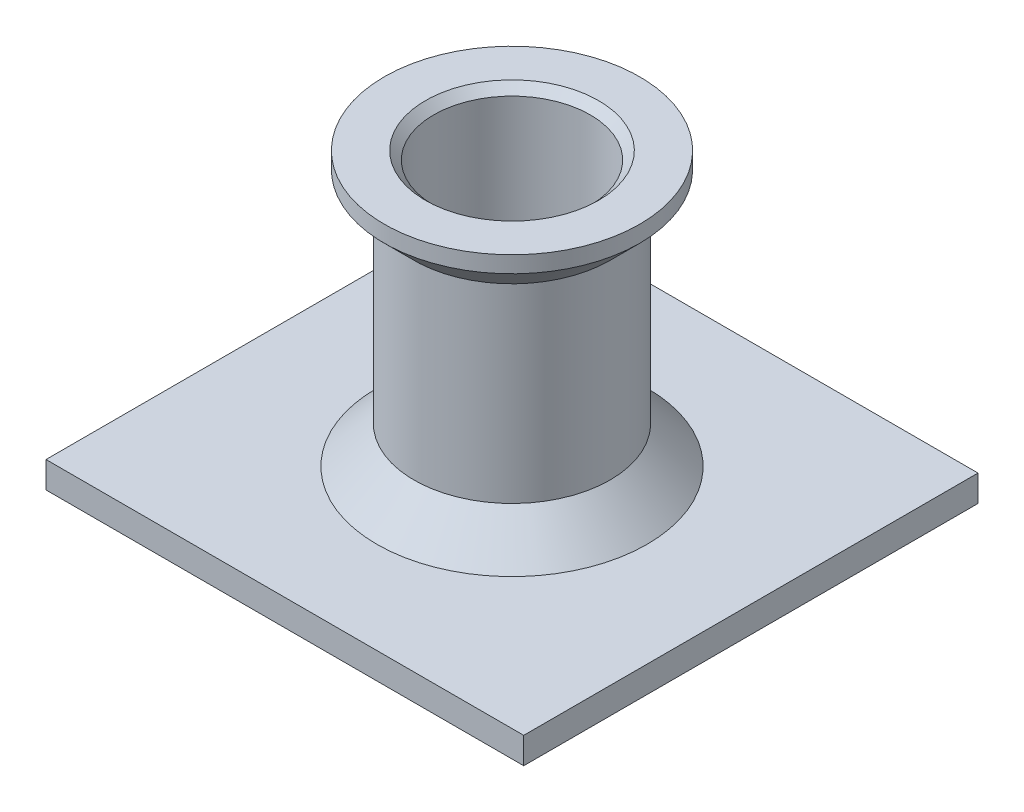
ISO-10303-21;
HEADER;
FILE_DESCRIPTION(('STEP AP214'),'2;1');
FILE_NAME('part.step','',(''),(''),'','','');
FILE_SCHEMA(('AUTOMOTIVE_DESIGN { 1 0 10303 214 1 1 1 1 }'));
ENDSEC;
DATA;
#1=APPLICATION_CONTEXT('core data for automotive mechanical design processes');
#2=APPLICATION_PROTOCOL_DEFINITION('international standard','automotive_design',2000,#1);
#3=PRODUCT_CONTEXT('',#1,'mechanical');
#4=PRODUCT('Part','Part','',(#3));
#5=PRODUCT_RELATED_PRODUCT_CATEGORY('part','',(#4));
#6=PRODUCT_DEFINITION_FORMATION('','',#4);
#7=PRODUCT_DEFINITION_CONTEXT('part definition',#1,'design');
#8=PRODUCT_DEFINITION('design','',#6,#7);
#9=PRODUCT_DEFINITION_SHAPE('','',#8);
#10=(LENGTH_UNIT() NAMED_UNIT(*) SI_UNIT(.MILLI.,.METRE.));
#11=(NAMED_UNIT(*) PLANE_ANGLE_UNIT() SI_UNIT($,.RADIAN.));
#12=(NAMED_UNIT(*) SI_UNIT($,.STERADIAN.) SOLID_ANGLE_UNIT());
#13=UNCERTAINTY_MEASURE_WITH_UNIT(LENGTH_MEASURE(1.E-05),#10,'distance_accuracy_value','');
#14=(GEOMETRIC_REPRESENTATION_CONTEXT(3) GLOBAL_UNCERTAINTY_ASSIGNED_CONTEXT((#13)) GLOBAL_UNIT_ASSIGNED_CONTEXT((#10,
#11,#12)) REPRESENTATION_CONTEXT('',''));
#15=CARTESIAN_POINT('',(0.,0.,0.));
#16=DIRECTION('',(0.,0.,1.));
#17=DIRECTION('',(1.,0.,0.));
#18=AXIS2_PLACEMENT_3D('',#15,#16,#17);
#19=CARTESIAN_POINT('',(20.,-8.19347301242441,0.));
#20=DIRECTION('',(0.,-1.,0.));
#21=DIRECTION('',(1.,0.,0.));
#22=AXIS2_PLACEMENT_3D('',#19,#20,#21);
#23=PLANE('',#22);
#24=CARTESIAN_POINT('',(0.,-8.19347301242441,0.));
#25=DIRECTION('',(0.,-1.,0.));
#26=DIRECTION('',(1.,0.,0.));
#27=AXIS2_PLACEMENT_3D('',#24,#25,#26);
#28=CIRCLE('',#27,3.25);
#29=CARTESIAN_POINT('',(3.25,-8.19347301242441,0.));
#30=VERTEX_POINT('',#29);
#31=EDGE_CURVE('E104',#30,#30,#28,.T.);
#32=ORIENTED_EDGE('',*,*,#31,.F.);
#33=EDGE_LOOP('',(#32));
#34=FACE_BOUND('',#33,.T.);
#35=DIRECTION('',(-1.,0.,0.));
#36=VECTOR('',#35,1.);
#37=CARTESIAN_POINT('',(-14.4934077622866,-8.19347301242441,-13.7819131994107));
#38=LINE('',#37,#36);
#39=CARTESIAN_POINT('',(14.4934077622866,-8.19347301242441,-13.7819131994107));
#40=VERTEX_POINT('',#39);
#41=CARTESIAN_POINT('',(-14.4934077622866,-8.19347301242441,-13.7819131994107));
#42=VERTEX_POINT('',#41);
#43=EDGE_CURVE('E92',#40,#42,#38,.T.);
#44=ORIENTED_EDGE('',*,*,#43,.F.);
#45=DIRECTION('',(0.,0.,-1.));
#46=VECTOR('',#45,1.);
#47=CARTESIAN_POINT('',(14.4934077622866,-8.19347301242441,-13.7819131994107));
#48=LINE('',#47,#46);
#49=CARTESIAN_POINT('',(14.4934077622866,-8.19347301242441,13.7819131994107));
#50=VERTEX_POINT('',#49);
#51=EDGE_CURVE('E49',#50,#40,#48,.T.);
#52=ORIENTED_EDGE('',*,*,#51,.F.);
#53=DIRECTION('',(1.,0.,0.));
#54=VECTOR('',#53,1.);
#55=CARTESIAN_POINT('',(-14.4934077622866,-8.19347301242441,13.7819131994107));
#56=LINE('',#55,#54);
#57=CARTESIAN_POINT('',(-14.4934077622866,-8.19347301242441,13.7819131994107));
#58=VERTEX_POINT('',#57);
#59=EDGE_CURVE('E81',#58,#50,#56,.T.);
#60=ORIENTED_EDGE('',*,*,#59,.F.);
#61=DIRECTION('',(0.,0.,1.));
#62=VECTOR('',#61,1.);
#63=CARTESIAN_POINT('',(-14.4934077622866,-8.19347301242441,-13.7819131994107));
#64=LINE('',#63,#62);
#65=EDGE_CURVE('E88',#42,#58,#64,.T.);
#66=ORIENTED_EDGE('',*,*,#65,.F.);
#67=EDGE_LOOP('',(#44,#52,#60,#66));
#68=FACE_BOUND('',#67,.T.);
#69=ADVANCED_FACE('F34',(#34,#68),#23,.T.);
#70=CARTESIAN_POINT('',(8.20084289882044,-6.59347301242441,0.));
#71=DIRECTION('',(0.,1.,0.));
#72=DIRECTION('',(-1.,0.,0.));
#73=AXIS2_PLACEMENT_3D('',#70,#71,#72);
#74=PLANE('',#73);
#75=CARTESIAN_POINT('',(0.,-6.59347301242441,0.));
#76=DIRECTION('',(0.,-1.,0.));
#77=DIRECTION('',(1.,0.,0.));
#78=AXIS2_PLACEMENT_3D('',#75,#76,#77);
#79=CIRCLE('',#78,8.20084289882044);
#80=CARTESIAN_POINT('',(8.20084289882044,-6.59347301242441,0.));
#81=VERTEX_POINT('',#80);
#82=EDGE_CURVE('E99',#81,#81,#79,.T.);
#83=ORIENTED_EDGE('',*,*,#82,.T.);
#84=EDGE_LOOP('',(#83));
#85=FACE_BOUND('',#84,.T.);
#86=DIRECTION('',(1.,0.,0.));
#87=VECTOR('',#86,1.);
#88=CARTESIAN_POINT('',(8.20084289882044,-6.59347301242441,13.7819131994107));
#89=LINE('',#88,#87);
#90=CARTESIAN_POINT('',(-14.4934077622866,-6.59347301242441,13.7819131994107));
#91=VERTEX_POINT('',#90);
#92=CARTESIAN_POINT('',(14.4934077622866,-6.59347301242441,13.7819131994107));
#93=VERTEX_POINT('',#92);
#94=EDGE_CURVE('E42',#91,#93,#89,.T.);
#95=ORIENTED_EDGE('',*,*,#94,.T.);
#96=DIRECTION('',(0.,0.,-1.));
#97=VECTOR('',#96,1.);
#98=CARTESIAN_POINT('',(14.4934077622866,-6.59347301242441,0.));
#99=LINE('',#98,#97);
#100=CARTESIAN_POINT('',(14.4934077622866,-6.59347301242441,-13.7819131994107));
#101=VERTEX_POINT('',#100);
#102=EDGE_CURVE('E12',#93,#101,#99,.T.);
#103=ORIENTED_EDGE('',*,*,#102,.T.);
#104=DIRECTION('',(-1.,0.,0.));
#105=VECTOR('',#104,1.);
#106=CARTESIAN_POINT('',(8.20084289882044,-6.59347301242441,-13.7819131994107));
#107=LINE('',#106,#105);
#108=CARTESIAN_POINT('',(-14.4934077622866,-6.59347301242441,-13.7819131994107));
#109=VERTEX_POINT('',#108);
#110=EDGE_CURVE('E131',#101,#109,#107,.T.);
#111=ORIENTED_EDGE('',*,*,#110,.T.);
#112=DIRECTION('',(0.,0.,1.));
#113=VECTOR('',#112,1.);
#114=CARTESIAN_POINT('',(-14.4934077622866,-6.59347301242441,0.));
#115=LINE('',#114,#113);
#116=EDGE_CURVE('E134',#109,#91,#115,.T.);
#117=ORIENTED_EDGE('',*,*,#116,.T.);
#118=EDGE_LOOP('',(#95,#103,#111,#117));
#119=FACE_BOUND('',#118,.T.);
#120=ADVANCED_FACE('F136',(#85,#119),#74,.T.);
#121=CARTESIAN_POINT('',(0.,-6.59347301242441,0.));
#122=DIRECTION('',(0.,-1.,0.));
#123=DIRECTION('',(1.,0.,0.));
#124=AXIS2_PLACEMENT_3D('',#121,#122,#123);
#125=CONICAL_SURFACE('',#124,8.20084289882044,0.785398163397449);
#126=CARTESIAN_POINT('',(0.,-4.34263011360397,0.));
#127=DIRECTION('',(0.,-1.,0.));
#128=DIRECTION('',(1.,0.,0.));
#129=AXIS2_PLACEMENT_3D('',#126,#127,#128);
#130=CIRCLE('',#129,5.95);
#131=CARTESIAN_POINT('',(5.95,-4.34263011360397,0.));
#132=VERTEX_POINT('',#131);
#133=EDGE_CURVE('E128',#132,#132,#130,.T.);
#134=ORIENTED_EDGE('',*,*,#133,.T.);
#135=EDGE_LOOP('',(#134));
#136=FACE_BOUND('',#135,.T.);
#137=ORIENTED_EDGE('',*,*,#82,.F.);
#138=EDGE_LOOP('',(#137));
#139=FACE_BOUND('',#138,.T.);
#140=ADVANCED_FACE('F36',(#136,#139),#125,.T.);
#141=CARTESIAN_POINT('',(0.,-12.923275862069,0.));
#142=DIRECTION('',(0.,-1.,0.));
#143=DIRECTION('',(1.,0.,0.));
#144=AXIS2_PLACEMENT_3D('',#141,#142,#143);
#145=CYLINDRICAL_SURFACE('',#144,5.95);
#146=CARTESIAN_POINT('',(0.,7.20000000000002,0.));
#147=DIRECTION('',(0.,-1.,0.));
#148=DIRECTION('',(1.,0.,0.));
#149=AXIS2_PLACEMENT_3D('',#146,#147,#148);
#150=CIRCLE('',#149,5.95000000000001);
#151=CARTESIAN_POINT('',(5.95000000000001,7.20000000000002,0.));
#152=VERTEX_POINT('',#151);
#153=EDGE_CURVE('E125',#152,#152,#150,.T.);
#154=ORIENTED_EDGE('',*,*,#153,.T.);
#155=EDGE_LOOP('',(#154));
#156=FACE_BOUND('',#155,.T.);
#157=ORIENTED_EDGE('',*,*,#133,.F.);
#158=EDGE_LOOP('',(#157));
#159=FACE_BOUND('',#158,.T.);
#160=ADVANCED_FACE('F182',(#156,#159),#145,.T.);
#161=CARTESIAN_POINT('',(0.,7.20000000000002,0.));
#162=DIRECTION('',(0.,1.,0.));
#163=DIRECTION('',(-1.,0.,0.));
#164=AXIS2_PLACEMENT_3D('',#161,#162,#163);
#165=CONICAL_SURFACE('',#164,5.95000000000001,0.785398163397454);
#166=CARTESIAN_POINT('',(0.,9.,0.));
#167=DIRECTION('',(0.,-1.,0.));
#168=DIRECTION('',(1.,0.,0.));
#169=AXIS2_PLACEMENT_3D('',#166,#167,#168);
#170=CIRCLE('',#169,7.75);
#171=CARTESIAN_POINT('',(7.75,9.,0.));
#172=VERTEX_POINT('',#171);
#173=EDGE_CURVE('E122',#172,#172,#170,.T.);
#174=ORIENTED_EDGE('',*,*,#173,.T.);
#175=EDGE_LOOP('',(#174));
#176=FACE_BOUND('',#175,.T.);
#177=ORIENTED_EDGE('',*,*,#153,.F.);
#178=EDGE_LOOP('',(#177));
#179=FACE_BOUND('',#178,.T.);
#180=ADVANCED_FACE('F179',(#176,#179),#165,.T.);
#181=CARTESIAN_POINT('',(0.,-12.923275862069,0.));
#182=DIRECTION('',(0.,-1.,0.));
#183=DIRECTION('',(1.,0.,0.));
#184=AXIS2_PLACEMENT_3D('',#181,#182,#183);
#185=CYLINDRICAL_SURFACE('',#184,7.75);
#186=CARTESIAN_POINT('',(0.,10.,0.));
#187=DIRECTION('',(0.,-1.,0.));
#188=DIRECTION('',(1.,0.,0.));
#189=AXIS2_PLACEMENT_3D('',#186,#187,#188);
#190=CIRCLE('',#189,7.75);
#191=CARTESIAN_POINT('',(7.75,10.,0.));
#192=VERTEX_POINT('',#191);
#193=EDGE_CURVE('E119',#192,#192,#190,.T.);
#194=ORIENTED_EDGE('',*,*,#193,.T.);
#195=EDGE_LOOP('',(#194));
#196=FACE_BOUND('',#195,.T.);
#197=ORIENTED_EDGE('',*,*,#173,.F.);
#198=EDGE_LOOP('',(#197));
#199=FACE_BOUND('',#198,.T.);
#200=ADVANCED_FACE('F175',(#196,#199),#185,.T.);
#201=CARTESIAN_POINT('',(5.25,10.,0.));
#202=DIRECTION('',(0.,1.,0.));
#203=DIRECTION('',(-1.,0.,0.));
#204=AXIS2_PLACEMENT_3D('',#201,#202,#203);
#205=PLANE('',#204);
#206=CARTESIAN_POINT('',(0.,10.,0.));
#207=DIRECTION('',(0.,-1.,0.));
#208=DIRECTION('',(1.,0.,0.));
#209=AXIS2_PLACEMENT_3D('',#206,#207,#208);
#210=CIRCLE('',#209,5.25);
#211=CARTESIAN_POINT('',(5.25,10.,0.));
#212=VERTEX_POINT('',#211);
#213=EDGE_CURVE('E116',#212,#212,#210,.T.);
#214=ORIENTED_EDGE('',*,*,#213,.T.);
#215=EDGE_LOOP('',(#214));
#216=FACE_BOUND('',#215,.T.);
#217=ORIENTED_EDGE('',*,*,#193,.F.);
#218=EDGE_LOOP('',(#217));
#219=FACE_BOUND('',#218,.T.);
#220=ADVANCED_FACE('F171',(#216,#219),#205,.T.);
#221=CARTESIAN_POINT('',(0.,10.,0.));
#222=DIRECTION('',(0.,1.,0.));
#223=DIRECTION('',(-1.,0.,0.));
#224=AXIS2_PLACEMENT_3D('',#221,#222,#223);
#225=CONICAL_SURFACE('',#224,5.25,0.785398163397447);
#226=CARTESIAN_POINT('',(0.,9.5,0.));
#227=DIRECTION('',(0.,-1.,0.));
#228=DIRECTION('',(1.,0.,0.));
#229=AXIS2_PLACEMENT_3D('',#226,#227,#228);
#230=CIRCLE('',#229,4.75);
#231=CARTESIAN_POINT('',(4.75,9.5,0.));
#232=VERTEX_POINT('',#231);
#233=EDGE_CURVE('E113',#232,#232,#230,.T.);
#234=ORIENTED_EDGE('',*,*,#233,.T.);
#235=EDGE_LOOP('',(#234));
#236=FACE_BOUND('',#235,.T.);
#237=ORIENTED_EDGE('',*,*,#213,.F.);
#238=EDGE_LOOP('',(#237));
#239=FACE_BOUND('',#238,.T.);
#240=ADVANCED_FACE('F167',(#236,#239),#225,.F.);
#241=CARTESIAN_POINT('',(0.,-12.923275862069,0.));
#242=DIRECTION('',(0.,-1.,0.));
#243=DIRECTION('',(1.,0.,0.));
#244=AXIS2_PLACEMENT_3D('',#241,#242,#243);
#245=CYLINDRICAL_SURFACE('',#244,4.75);
#246=CARTESIAN_POINT('',(0.,0.,0.));
#247=DIRECTION('',(0.,-1.,0.));
#248=DIRECTION('',(1.,0.,0.));
#249=AXIS2_PLACEMENT_3D('',#246,#247,#248);
#250=CIRCLE('',#249,4.75);
#251=CARTESIAN_POINT('',(4.75,0.,0.));
#252=VERTEX_POINT('',#251);
#253=EDGE_CURVE('E110',#252,#252,#250,.T.);
#254=ORIENTED_EDGE('',*,*,#253,.T.);
#255=EDGE_LOOP('',(#254));
#256=FACE_BOUND('',#255,.T.);
#257=ORIENTED_EDGE('',*,*,#233,.F.);
#258=EDGE_LOOP('',(#257));
#259=FACE_BOUND('',#258,.T.);
#260=ADVANCED_FACE('F163',(#256,#259),#245,.F.);
#261=CARTESIAN_POINT('',(0.,0.,0.));
#262=DIRECTION('',(0.,1.,0.));
#263=DIRECTION('',(-1.,0.,0.));
#264=AXIS2_PLACEMENT_3D('',#261,#262,#263);
#265=CONICAL_SURFACE('',#264,4.75,0.785398163397445);
#266=CARTESIAN_POINT('',(0.,-1.50000000000001,0.));
#267=DIRECTION('',(0.,-1.,0.));
#268=DIRECTION('',(1.,0.,0.));
#269=AXIS2_PLACEMENT_3D('',#266,#267,#268);
#270=CIRCLE('',#269,3.25);
#271=CARTESIAN_POINT('',(3.25,-1.50000000000001,0.));
#272=VERTEX_POINT('',#271);
#273=EDGE_CURVE('E107',#272,#272,#270,.T.);
#274=ORIENTED_EDGE('',*,*,#273,.T.);
#275=EDGE_LOOP('',(#274));
#276=FACE_BOUND('',#275,.T.);
#277=ORIENTED_EDGE('',*,*,#253,.F.);
#278=EDGE_LOOP('',(#277));
#279=FACE_BOUND('',#278,.T.);
#280=ADVANCED_FACE('F147',(#276,#279),#265,.F.);
#281=CARTESIAN_POINT('',(0.,-12.923275862069,0.));
#282=DIRECTION('',(0.,-1.,0.));
#283=DIRECTION('',(1.,0.,0.));
#284=AXIS2_PLACEMENT_3D('',#281,#282,#283);
#285=CYLINDRICAL_SURFACE('',#284,3.25);
#286=ORIENTED_EDGE('',*,*,#31,.T.);
#287=EDGE_LOOP('',(#286));
#288=FACE_BOUND('',#287,.T.);
#289=ORIENTED_EDGE('',*,*,#273,.F.);
#290=EDGE_LOOP('',(#289));
#291=FACE_BOUND('',#290,.T.);
#292=ADVANCED_FACE('F140',(#288,#291),#285,.F.);
#293=CARTESIAN_POINT('',(14.4934077622866,-8.19347301242441,-13.7819131994107));
#294=DIRECTION('',(1.,0.,0.));
#295=DIRECTION('',(0.,0.,-1.));
#296=AXIS2_PLACEMENT_3D('',#293,#294,#295);
#297=PLANE('',#296);
#298=DIRECTION('',(0.,1.,0.));
#299=VECTOR('',#298,1.);
#300=CARTESIAN_POINT('',(14.4934077622866,-8.19347301242441,13.7819131994107));
#301=LINE('',#300,#299);
#302=EDGE_CURVE('E85',#50,#93,#301,.T.);
#303=ORIENTED_EDGE('',*,*,#302,.F.);
#304=ORIENTED_EDGE('',*,*,#51,.T.);
#305=DIRECTION('',(0.,1.,0.));
#306=VECTOR('',#305,1.);
#307=CARTESIAN_POINT('',(14.4934077622866,-8.19347301242441,-13.7819131994107));
#308=LINE('',#307,#306);
#309=EDGE_CURVE('E94',#40,#101,#308,.T.);
#310=ORIENTED_EDGE('',*,*,#309,.T.);
#311=ORIENTED_EDGE('',*,*,#102,.F.);
#312=EDGE_LOOP('',(#303,#304,#310,#311));
#313=FACE_BOUND('',#312,.T.);
#314=ADVANCED_FACE('F138',(#313),#297,.T.);
#315=CARTESIAN_POINT('',(-14.4934077622866,-8.19347301242441,13.7819131994107));
#316=DIRECTION('',(0.,0.,1.));
#317=DIRECTION('',(1.,0.,0.));
#318=AXIS2_PLACEMENT_3D('',#315,#316,#317);
#319=PLANE('',#318);
#320=DIRECTION('',(0.,1.,0.));
#321=VECTOR('',#320,1.);
#322=CARTESIAN_POINT('',(-14.4934077622866,-8.19347301242441,13.7819131994107));
#323=LINE('',#322,#321);
#324=EDGE_CURVE('E76',#58,#91,#323,.T.);
#325=ORIENTED_EDGE('',*,*,#324,.F.);
#326=ORIENTED_EDGE('',*,*,#59,.T.);
#327=ORIENTED_EDGE('',*,*,#302,.T.);
#328=ORIENTED_EDGE('',*,*,#94,.F.);
#329=EDGE_LOOP('',(#325,#326,#327,#328));
#330=FACE_BOUND('',#329,.T.);
#331=ADVANCED_FACE('F78',(#330),#319,.T.);
#332=CARTESIAN_POINT('',(-14.4934077622866,-8.19347301242441,-13.7819131994107));
#333=DIRECTION('',(-1.,0.,0.));
#334=DIRECTION('',(0.,0.,1.));
#335=AXIS2_PLACEMENT_3D('',#332,#333,#334);
#336=PLANE('',#335);
#337=DIRECTION('',(0.,1.,0.));
#338=VECTOR('',#337,1.);
#339=CARTESIAN_POINT('',(-14.4934077622866,-8.19347301242441,-13.7819131994107));
#340=LINE('',#339,#338);
#341=EDGE_CURVE('E57',#42,#109,#340,.T.);
#342=ORIENTED_EDGE('',*,*,#341,.F.);
#343=ORIENTED_EDGE('',*,*,#65,.T.);
#344=ORIENTED_EDGE('',*,*,#324,.T.);
#345=ORIENTED_EDGE('',*,*,#116,.F.);
#346=EDGE_LOOP('',(#342,#343,#344,#345));
#347=FACE_BOUND('',#346,.T.);
#348=ADVANCED_FACE('F89',(#347),#336,.T.);
#349=CARTESIAN_POINT('',(-14.4934077622866,-8.19347301242441,-13.7819131994107));
#350=DIRECTION('',(0.,0.,-1.));
#351=DIRECTION('',(-1.,0.,0.));
#352=AXIS2_PLACEMENT_3D('',#349,#350,#351);
#353=PLANE('',#352);
#354=ORIENTED_EDGE('',*,*,#309,.F.);
#355=ORIENTED_EDGE('',*,*,#43,.T.);
#356=ORIENTED_EDGE('',*,*,#341,.T.);
#357=ORIENTED_EDGE('',*,*,#110,.F.);
#358=EDGE_LOOP('',(#354,#355,#356,#357));
#359=FACE_BOUND('',#358,.T.);
#360=ADVANCED_FACE('F137',(#359),#353,.T.);
#361=CLOSED_SHELL('',(#69,#120,#140,#160,#180,#200,#220,#240,#260,#280,#292,#314,#331,#348,#360));
#362=MANIFOLD_SOLID_BREP('B2',#361);
#363=ADVANCED_BREP_SHAPE_REPRESENTATION('',(#18,#362),#14);
#364=SHAPE_DEFINITION_REPRESENTATION(#9,#363);
ENDSEC;
END-ISO-10303-21;
